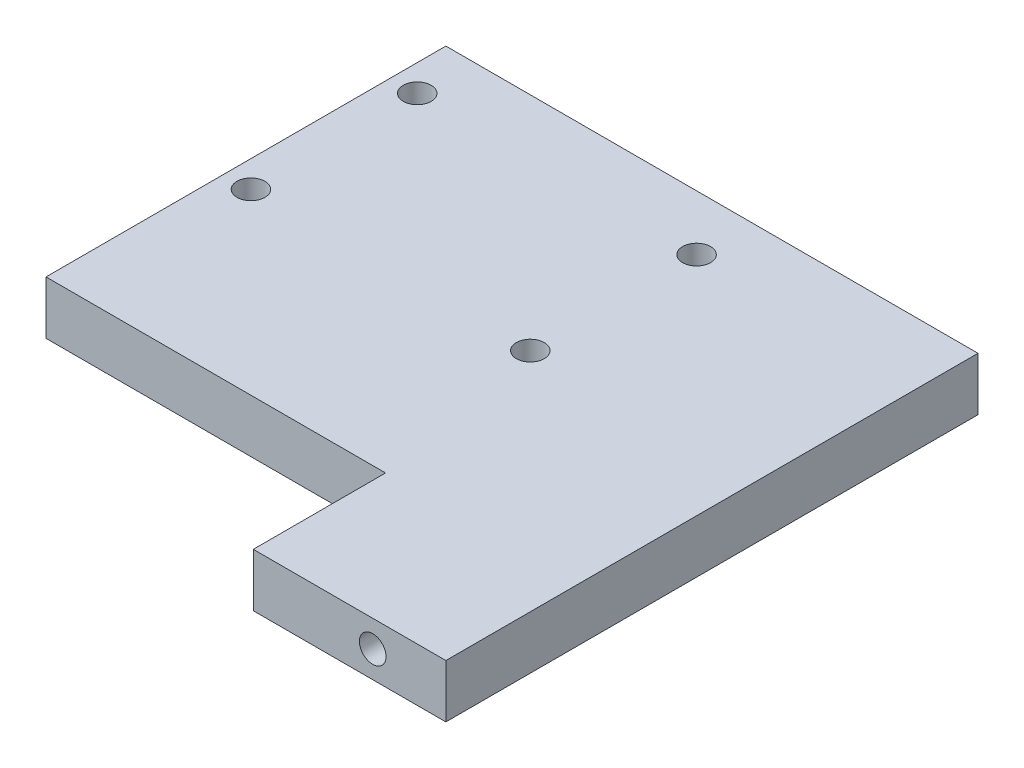
ISO-10303-21;
HEADER;
FILE_DESCRIPTION(('STEP AP214'),'2;1');
FILE_NAME('part.step','',(''),(''),'','','');
FILE_SCHEMA(('AUTOMOTIVE_DESIGN { 1 0 10303 214 1 1 1 1 }'));
ENDSEC;
DATA;
#1=APPLICATION_CONTEXT('core data for automotive mechanical design processes');
#2=APPLICATION_PROTOCOL_DEFINITION('international standard','automotive_design',2000,#1);
#3=PRODUCT_CONTEXT('',#1,'mechanical');
#4=PRODUCT('Part','Part','',(#3));
#5=PRODUCT_RELATED_PRODUCT_CATEGORY('part','',(#4));
#6=PRODUCT_DEFINITION_FORMATION('','',#4);
#7=PRODUCT_DEFINITION_CONTEXT('part definition',#1,'design');
#8=PRODUCT_DEFINITION('design','',#6,#7);
#9=PRODUCT_DEFINITION_SHAPE('','',#8);
#10=(LENGTH_UNIT() NAMED_UNIT(*) SI_UNIT(.MILLI.,.METRE.));
#11=(NAMED_UNIT(*) PLANE_ANGLE_UNIT() SI_UNIT($,.RADIAN.));
#12=(NAMED_UNIT(*) SI_UNIT($,.STERADIAN.) SOLID_ANGLE_UNIT());
#13=UNCERTAINTY_MEASURE_WITH_UNIT(LENGTH_MEASURE(1.E-05),#10,'distance_accuracy_value','');
#14=(GEOMETRIC_REPRESENTATION_CONTEXT(3) GLOBAL_UNCERTAINTY_ASSIGNED_CONTEXT((#13)) GLOBAL_UNIT_ASSIGNED_CONTEXT((#10,
#11,#12)) REPRESENTATION_CONTEXT('',''));
#15=CARTESIAN_POINT('',(0.,0.,0.));
#16=DIRECTION('',(0.,0.,1.));
#17=DIRECTION('',(1.,0.,0.));
#18=AXIS2_PLACEMENT_3D('',#15,#16,#17);
#19=CARTESIAN_POINT('',(20.,4.,20.));
#20=DIRECTION('',(-1.,0.,0.));
#21=DIRECTION('',(0.,0.,1.));
#22=AXIS2_PLACEMENT_3D('',#19,#20,#21);
#23=PLANE('',#22);
#24=DIRECTION('',(0.,0.,-1.));
#25=VECTOR('',#24,1.);
#26=CARTESIAN_POINT('',(20.,0.,20.));
#27=LINE('',#26,#25);
#28=CARTESIAN_POINT('',(20.,0.,20.));
#29=VERTEX_POINT('',#28);
#30=CARTESIAN_POINT('',(20.,0.,-20.));
#31=VERTEX_POINT('',#30);
#32=EDGE_CURVE('E141',#29,#31,#27,.T.);
#33=ORIENTED_EDGE('',*,*,#32,.T.);
#34=DIRECTION('',(0.,-1.,0.));
#35=VECTOR('',#34,1.);
#36=CARTESIAN_POINT('',(20.,4.,-20.));
#37=LINE('',#36,#35);
#38=CARTESIAN_POINT('',(20.,4.,-20.));
#39=VERTEX_POINT('',#38);
#40=EDGE_CURVE('E11',#39,#31,#37,.T.);
#41=ORIENTED_EDGE('',*,*,#40,.F.);
#42=DIRECTION('',(0.,0.,-1.));
#43=VECTOR('',#42,1.);
#44=CARTESIAN_POINT('',(20.,4.,20.));
#45=LINE('',#44,#43);
#46=CARTESIAN_POINT('',(20.,4.,20.));
#47=VERTEX_POINT('',#46);
#48=EDGE_CURVE('E137',#47,#39,#45,.T.);
#49=ORIENTED_EDGE('',*,*,#48,.F.);
#50=DIRECTION('',(0.,-1.,0.));
#51=VECTOR('',#50,1.);
#52=CARTESIAN_POINT('',(20.,4.,20.));
#53=LINE('',#52,#51);
#54=EDGE_CURVE('E135',#47,#29,#53,.T.);
#55=ORIENTED_EDGE('',*,*,#54,.T.);
#56=EDGE_LOOP('',(#33,#41,#49,#55));
#57=FACE_BOUND('',#56,.T.);
#58=ADVANCED_FACE('F35',(#57),#23,.F.);
#59=CARTESIAN_POINT('',(-20.,4.,-20.));
#60=DIRECTION('',(0.,0.,1.));
#61=DIRECTION('',(1.,0.,0.));
#62=AXIS2_PLACEMENT_3D('',#59,#60,#61);
#63=PLANE('',#62);
#64=CARTESIAN_POINT('',(-14.5,2.,-20.));
#65=DIRECTION('',(0.,0.,-1.));
#66=DIRECTION('',(-1.,0.,0.));
#67=AXIS2_PLACEMENT_3D('',#64,#65,#66);
#68=CIRCLE('',#67,1.);
#69=CARTESIAN_POINT('',(-15.5,2.,-20.));
#70=VERTEX_POINT('',#69);
#71=EDGE_CURVE('E187',#70,#70,#68,.T.);
#72=ORIENTED_EDGE('',*,*,#71,.F.);
#73=EDGE_LOOP('',(#72));
#74=FACE_BOUND('',#73,.T.);
#75=CARTESIAN_POINT('',(14.5,2.,-20.));
#76=DIRECTION('',(0.,0.,-1.));
#77=DIRECTION('',(-1.,0.,0.));
#78=AXIS2_PLACEMENT_3D('',#75,#76,#77);
#79=CIRCLE('',#78,1.);
#80=CARTESIAN_POINT('',(13.5,2.,-20.));
#81=VERTEX_POINT('',#80);
#82=EDGE_CURVE('E191',#81,#81,#79,.T.);
#83=ORIENTED_EDGE('',*,*,#82,.F.);
#84=EDGE_LOOP('',(#83));
#85=FACE_BOUND('',#84,.T.);
#86=DIRECTION('',(-1.,0.,0.));
#87=VECTOR('',#86,1.);
#88=CARTESIAN_POINT('',(-20.,0.,-20.));
#89=LINE('',#88,#87);
#90=CARTESIAN_POINT('',(-20.,0.,-20.));
#91=VERTEX_POINT('',#90);
#92=EDGE_CURVE('E144',#31,#91,#89,.T.);
#93=ORIENTED_EDGE('',*,*,#92,.T.);
#94=DIRECTION('',(0.,-1.,0.));
#95=VECTOR('',#94,1.);
#96=CARTESIAN_POINT('',(-20.,4.,-20.));
#97=LINE('',#96,#95);
#98=CARTESIAN_POINT('',(-20.,4.,-20.));
#99=VERTEX_POINT('',#98);
#100=EDGE_CURVE('E42',#99,#91,#97,.T.);
#101=ORIENTED_EDGE('',*,*,#100,.F.);
#102=DIRECTION('',(-1.,0.,0.));
#103=VECTOR('',#102,1.);
#104=CARTESIAN_POINT('',(-20.,4.,-20.));
#105=LINE('',#104,#103);
#106=EDGE_CURVE('E131',#39,#99,#105,.T.);
#107=ORIENTED_EDGE('',*,*,#106,.F.);
#108=ORIENTED_EDGE('',*,*,#40,.T.);
#109=EDGE_LOOP('',(#93,#101,#107,#108));
#110=FACE_BOUND('',#109,.T.);
#111=ADVANCED_FACE('F208',(#74,#85,#110),#63,.F.);
#112=CARTESIAN_POINT('',(-20.,4.,20.));
#113=DIRECTION('',(1.,0.,0.));
#114=DIRECTION('',(0.,0.,-1.));
#115=AXIS2_PLACEMENT_3D('',#112,#113,#114);
#116=PLANE('',#115);
#117=DIRECTION('',(0.,0.,1.));
#118=VECTOR('',#117,1.);
#119=CARTESIAN_POINT('',(-20.,0.,20.));
#120=LINE('',#119,#118);
#121=CARTESIAN_POINT('',(-20.,0.,-0.123296756228797));
#122=VERTEX_POINT('',#121);
#123=CARTESIAN_POINT('',(-20.,0.,10.0582705619843));
#124=VERTEX_POINT('',#123);
#125=EDGE_CURVE('E127',#122,#124,#120,.T.);
#126=ORIENTED_EDGE('',*,*,#125,.T.);
#127=DIRECTION('',(0.,-1.,0.));
#128=VECTOR('',#127,1.);
#129=CARTESIAN_POINT('',(-20.,4.,10.0582705619843));
#130=LINE('',#129,#128);
#131=CARTESIAN_POINT('',(-20.,4.,10.0582705619843));
#132=VERTEX_POINT('',#131);
#133=EDGE_CURVE('E49',#132,#124,#130,.T.);
#134=ORIENTED_EDGE('',*,*,#133,.F.);
#135=DIRECTION('',(0.,0.,1.));
#136=VECTOR('',#135,1.);
#137=CARTESIAN_POINT('',(-20.,4.,20.));
#138=LINE('',#137,#136);
#139=EDGE_CURVE('E125',#99,#132,#138,.T.);
#140=ORIENTED_EDGE('',*,*,#139,.F.);
#141=ORIENTED_EDGE('',*,*,#100,.T.);
#142=CARTESIAN_POINT('',(-20.,0.,-17.8471805011251));
#143=VERTEX_POINT('',#142);
#144=EDGE_CURVE('E147',#91,#143,#120,.T.);
#145=ORIENTED_EDGE('',*,*,#144,.T.);
#146=DIRECTION('',(0.,1.,0.));
#147=VECTOR('',#146,1.);
#148=CARTESIAN_POINT('',(-20.,-1.,-17.8471805011251));
#149=LINE('',#148,#147);
#150=CARTESIAN_POINT('',(-20.,-1.,-17.8471805011251));
#151=VERTEX_POINT('',#150);
#152=EDGE_CURVE('E178',#151,#143,#149,.T.);
#153=ORIENTED_EDGE('',*,*,#152,.F.);
#154=DIRECTION('',(0.,0.,-1.));
#155=VECTOR('',#154,1.);
#156=CARTESIAN_POINT('',(-20.,-1.,-0.123296756228797));
#157=LINE('',#156,#155);
#158=CARTESIAN_POINT('',(-20.,-1.,-0.123296756228797));
#159=VERTEX_POINT('',#158);
#160=EDGE_CURVE('E172',#159,#151,#157,.T.);
#161=ORIENTED_EDGE('',*,*,#160,.F.);
#162=DIRECTION('',(0.,1.,0.));
#163=VECTOR('',#162,1.);
#164=CARTESIAN_POINT('',(-20.,-1.,-0.123296756228797));
#165=LINE('',#164,#163);
#166=EDGE_CURVE('E180',#159,#122,#165,.T.);
#167=ORIENTED_EDGE('',*,*,#166,.T.);
#168=EDGE_LOOP('',(#126,#134,#140,#141,#145,#153,#161,#167));
#169=FACE_BOUND('',#168,.T.);
#170=ADVANCED_FACE('F123',(#169),#116,.F.);
#171=CARTESIAN_POINT('',(-20.,4.,20.));
#172=DIRECTION('',(0.,0.,-1.));
#173=DIRECTION('',(-1.,0.,0.));
#174=AXIS2_PLACEMENT_3D('',#171,#172,#173);
#175=PLANE('',#174);
#176=CARTESIAN_POINT('',(14.5,2.,20.));
#177=DIRECTION('',(0.,0.,1.));
#178=DIRECTION('',(1.,0.,0.));
#179=AXIS2_PLACEMENT_3D('',#176,#177,#178);
#180=CIRCLE('',#179,1.);
#181=CARTESIAN_POINT('',(15.5,2.,20.));
#182=VERTEX_POINT('',#181);
#183=EDGE_CURVE('E197',#182,#182,#180,.T.);
#184=ORIENTED_EDGE('',*,*,#183,.F.);
#185=EDGE_LOOP('',(#184));
#186=FACE_BOUND('',#185,.T.);
#187=DIRECTION('',(1.,0.,0.));
#188=VECTOR('',#187,1.);
#189=CARTESIAN_POINT('',(-20.,4.,20.));
#190=LINE('',#189,#188);
#191=CARTESIAN_POINT('',(5.52379311554674,4.,20.));
#192=VERTEX_POINT('',#191);
#193=EDGE_CURVE('E133',#192,#47,#190,.T.);
#194=ORIENTED_EDGE('',*,*,#193,.F.);
#195=DIRECTION('',(0.,-1.,0.));
#196=VECTOR('',#195,1.);
#197=CARTESIAN_POINT('',(5.52379311554674,4.,20.));
#198=LINE('',#197,#196);
#199=CARTESIAN_POINT('',(5.52379311554674,0.,20.));
#200=VERTEX_POINT('',#199);
#201=EDGE_CURVE('E291',#192,#200,#198,.T.);
#202=ORIENTED_EDGE('',*,*,#201,.T.);
#203=DIRECTION('',(1.,0.,0.));
#204=VECTOR('',#203,1.);
#205=CARTESIAN_POINT('',(-20.,0.,20.));
#206=LINE('',#205,#204);
#207=EDGE_CURVE('E150',#200,#29,#206,.T.);
#208=ORIENTED_EDGE('',*,*,#207,.T.);
#209=ORIENTED_EDGE('',*,*,#54,.F.);
#210=EDGE_LOOP('',(#194,#202,#208,#209));
#211=FACE_BOUND('',#210,.T.);
#212=ADVANCED_FACE('F215',(#186,#211),#175,.F.);
#213=CARTESIAN_POINT('',(0.,4.,0.));
#214=DIRECTION('',(0.,-1.,0.));
#215=DIRECTION('',(0.,0.,-1.));
#216=AXIS2_PLACEMENT_3D('',#213,#214,#215);
#217=PLANE('',#216);
#218=CARTESIAN_POINT('',(2.99888780924207,4.,-15.8460683103671));
#219=DIRECTION('',(0.,-1.,0.));
#220=DIRECTION('',(0.,0.,-1.));
#221=AXIS2_PLACEMENT_3D('',#218,#219,#220);
#222=CIRCLE('',#221,1.05);
#223=CARTESIAN_POINT('',(2.99888780924207,4.,-16.8960683103671));
#224=VERTEX_POINT('',#223);
#225=EDGE_CURVE('E304',#224,#224,#222,.T.);
#226=ORIENTED_EDGE('',*,*,#225,.T.);
#227=EDGE_LOOP('',(#226));
#228=FACE_BOUND('',#227,.T.);
#229=CARTESIAN_POINT('',(2.99888780924207,4.,-3.34606831036715));
#230=DIRECTION('',(0.,-1.,0.));
#231=DIRECTION('',(0.,0.,-1.));
#232=AXIS2_PLACEMENT_3D('',#229,#230,#231);
#233=CIRCLE('',#232,1.05);
#234=CARTESIAN_POINT('',(2.99888780924207,4.,-4.39606831036715));
#235=VERTEX_POINT('',#234);
#236=EDGE_CURVE('E299',#235,#235,#233,.T.);
#237=ORIENTED_EDGE('',*,*,#236,.T.);
#238=EDGE_LOOP('',(#237));
#239=FACE_BOUND('',#238,.T.);
#240=CARTESIAN_POINT('',(-17.9988878092421,4.,-3.34606831036715));
#241=DIRECTION('',(0.,-1.,0.));
#242=DIRECTION('',(0.,0.,-1.));
#243=AXIS2_PLACEMENT_3D('',#240,#241,#242);
#244=CIRCLE('',#243,1.05);
#245=CARTESIAN_POINT('',(-17.9988878092421,4.,-4.39606831036715));
#246=VERTEX_POINT('',#245);
#247=EDGE_CURVE('E296',#246,#246,#244,.T.);
#248=ORIENTED_EDGE('',*,*,#247,.T.);
#249=EDGE_LOOP('',(#248));
#250=FACE_BOUND('',#249,.T.);
#251=CARTESIAN_POINT('',(-17.9988878092421,4.,-15.8460683103671));
#252=DIRECTION('',(0.,-1.,0.));
#253=DIRECTION('',(0.,0.,-1.));
#254=AXIS2_PLACEMENT_3D('',#251,#252,#253);
#255=CIRCLE('',#254,1.05);
#256=CARTESIAN_POINT('',(-17.9988878092421,4.,-16.8960683103671));
#257=VERTEX_POINT('',#256);
#258=EDGE_CURVE('E307',#257,#257,#255,.T.);
#259=ORIENTED_EDGE('',*,*,#258,.T.);
#260=EDGE_LOOP('',(#259));
#261=FACE_BOUND('',#260,.T.);
#262=DIRECTION('',(1.,0.,0.));
#263=VECTOR('',#262,1.);
#264=CARTESIAN_POINT('',(-20.,4.,10.0582705619843));
#265=LINE('',#264,#263);
#266=CARTESIAN_POINT('',(5.52379311554674,4.,10.0582705619843));
#267=VERTEX_POINT('',#266);
#268=EDGE_CURVE('E110',#132,#267,#265,.T.);
#269=ORIENTED_EDGE('',*,*,#268,.T.);
#270=DIRECTION('',(0.,0.,1.));
#271=VECTOR('',#270,1.);
#272=CARTESIAN_POINT('',(5.52379311554674,4.,10.0582705619843));
#273=LINE('',#272,#271);
#274=EDGE_CURVE('E117',#267,#192,#273,.T.);
#275=ORIENTED_EDGE('',*,*,#274,.T.);
#276=ORIENTED_EDGE('',*,*,#193,.T.);
#277=ORIENTED_EDGE('',*,*,#48,.T.);
#278=ORIENTED_EDGE('',*,*,#106,.T.);
#279=ORIENTED_EDGE('',*,*,#139,.T.);
#280=EDGE_LOOP('',(#269,#275,#276,#277,#278,#279));
#281=FACE_BOUND('',#280,.T.);
#282=ADVANCED_FACE('F129',(#228,#239,#250,#261,#281),#217,.F.);
#283=CARTESIAN_POINT('',(0.,0.,0.));
#284=DIRECTION('',(0.,-1.,0.));
#285=DIRECTION('',(0.,0.,-1.));
#286=AXIS2_PLACEMENT_3D('',#283,#284,#285);
#287=PLANE('',#286);
#288=DIRECTION('',(0.,0.,1.));
#289=VECTOR('',#288,1.);
#290=CARTESIAN_POINT('',(5.52379311554674,0.,10.0582705619843));
#291=LINE('',#290,#289);
#292=CARTESIAN_POINT('',(5.52379311554674,0.,10.0582705619843));
#293=VERTEX_POINT('',#292);
#294=EDGE_CURVE('E118',#293,#200,#291,.T.);
#295=ORIENTED_EDGE('',*,*,#294,.F.);
#296=DIRECTION('',(1.,0.,0.));
#297=VECTOR('',#296,1.);
#298=CARTESIAN_POINT('',(-20.,0.,10.0582705619843));
#299=LINE('',#298,#297);
#300=EDGE_CURVE('E293',#124,#293,#299,.T.);
#301=ORIENTED_EDGE('',*,*,#300,.F.);
#302=ORIENTED_EDGE('',*,*,#125,.F.);
#303=DIRECTION('',(-1.,0.,0.));
#304=VECTOR('',#303,1.);
#305=CARTESIAN_POINT('',(5.,0.,-0.123296756228797));
#306=LINE('',#305,#304);
#307=CARTESIAN_POINT('',(5.,0.,-0.123296756228797));
#308=VERTEX_POINT('',#307);
#309=EDGE_CURVE('E166',#308,#122,#306,.T.);
#310=ORIENTED_EDGE('',*,*,#309,.F.);
#311=DIRECTION('',(0.,0.,1.));
#312=VECTOR('',#311,1.);
#313=CARTESIAN_POINT('',(5.,0.,-0.123296756228797));
#314=LINE('',#313,#312);
#315=CARTESIAN_POINT('',(5.,0.,-17.8471805011251));
#316=VERTEX_POINT('',#315);
#317=EDGE_CURVE('E57',#316,#308,#314,.T.);
#318=ORIENTED_EDGE('',*,*,#317,.F.);
#319=DIRECTION('',(1.,0.,0.));
#320=VECTOR('',#319,1.);
#321=CARTESIAN_POINT('',(5.,0.,-17.8471805011251));
#322=LINE('',#321,#320);
#323=EDGE_CURVE('E161',#143,#316,#322,.T.);
#324=ORIENTED_EDGE('',*,*,#323,.F.);
#325=ORIENTED_EDGE('',*,*,#144,.F.);
#326=ORIENTED_EDGE('',*,*,#92,.F.);
#327=ORIENTED_EDGE('',*,*,#32,.F.);
#328=ORIENTED_EDGE('',*,*,#207,.F.);
#329=EDGE_LOOP('',(#295,#301,#302,#310,#318,#324,#325,#326,#327,#328));
#330=FACE_BOUND('',#329,.T.);
#331=ADVANCED_FACE('F158',(#330),#287,.T.);
#332=CARTESIAN_POINT('',(14.5,2.,18.));
#333=DIRECTION('',(0.,0.,1.));
#334=DIRECTION('',(1.,0.,0.));
#335=AXIS2_PLACEMENT_3D('',#332,#333,#334);
#336=CYLINDRICAL_SURFACE('',#335,1.);
#337=CARTESIAN_POINT('',(14.5,2.,18.));
#338=DIRECTION('',(0.,0.,1.));
#339=DIRECTION('',(1.,0.,0.));
#340=AXIS2_PLACEMENT_3D('',#337,#338,#339);
#341=CIRCLE('',#340,1.);
#342=CARTESIAN_POINT('',(15.5,2.,18.));
#343=VERTEX_POINT('',#342);
#344=EDGE_CURVE('E145',#343,#343,#341,.T.);
#345=ORIENTED_EDGE('',*,*,#344,.F.);
#346=EDGE_LOOP('',(#345));
#347=FACE_BOUND('',#346,.T.);
#348=ORIENTED_EDGE('',*,*,#183,.T.);
#349=EDGE_LOOP('',(#348));
#350=FACE_BOUND('',#349,.T.);
#351=ADVANCED_FACE('F225',(#347,#350),#336,.F.);
#352=CARTESIAN_POINT('',(14.5,2.,18.));
#353=DIRECTION('',(0.,0.,1.));
#354=DIRECTION('',(1.,0.,0.));
#355=AXIS2_PLACEMENT_3D('',#352,#353,#354);
#356=PLANE('',#355);
#357=ORIENTED_EDGE('',*,*,#344,.T.);
#358=EDGE_LOOP('',(#357));
#359=FACE_BOUND('',#358,.T.);
#360=ADVANCED_FACE('F231',(#359),#356,.T.);
#361=CARTESIAN_POINT('',(14.5,2.,-18.));
#362=DIRECTION('',(0.,0.,-1.));
#363=DIRECTION('',(-1.,0.,0.));
#364=AXIS2_PLACEMENT_3D('',#361,#362,#363);
#365=CYLINDRICAL_SURFACE('',#364,1.);
#366=CARTESIAN_POINT('',(14.5,2.,-18.));
#367=DIRECTION('',(0.,0.,-1.));
#368=DIRECTION('',(-1.,0.,0.));
#369=AXIS2_PLACEMENT_3D('',#366,#367,#368);
#370=CIRCLE('',#369,1.);
#371=CARTESIAN_POINT('',(13.5,2.,-18.));
#372=VERTEX_POINT('',#371);
#373=EDGE_CURVE('E194',#372,#372,#370,.T.);
#374=ORIENTED_EDGE('',*,*,#373,.F.);
#375=EDGE_LOOP('',(#374));
#376=FACE_BOUND('',#375,.T.);
#377=ORIENTED_EDGE('',*,*,#82,.T.);
#378=EDGE_LOOP('',(#377));
#379=FACE_BOUND('',#378,.T.);
#380=ADVANCED_FACE('F235',(#376,#379),#365,.F.);
#381=CARTESIAN_POINT('',(14.5,2.,-18.));
#382=DIRECTION('',(0.,0.,-1.));
#383=DIRECTION('',(-1.,0.,0.));
#384=AXIS2_PLACEMENT_3D('',#381,#382,#383);
#385=PLANE('',#384);
#386=ORIENTED_EDGE('',*,*,#373,.T.);
#387=EDGE_LOOP('',(#386));
#388=FACE_BOUND('',#387,.T.);
#389=ADVANCED_FACE('F239',(#388),#385,.T.);
#390=CARTESIAN_POINT('',(-14.5,2.,-18.));
#391=DIRECTION('',(0.,0.,-1.));
#392=DIRECTION('',(-1.,0.,0.));
#393=AXIS2_PLACEMENT_3D('',#390,#391,#392);
#394=CYLINDRICAL_SURFACE('',#393,1.);
#395=CARTESIAN_POINT('',(-14.5,2.,-18.));
#396=DIRECTION('',(0.,0.,-1.));
#397=DIRECTION('',(-1.,0.,0.));
#398=AXIS2_PLACEMENT_3D('',#395,#396,#397);
#399=CIRCLE('',#398,1.);
#400=CARTESIAN_POINT('',(-15.5,2.,-18.));
#401=VERTEX_POINT('',#400);
#402=EDGE_CURVE('E188',#401,#401,#399,.T.);
#403=ORIENTED_EDGE('',*,*,#402,.F.);
#404=EDGE_LOOP('',(#403));
#405=FACE_BOUND('',#404,.T.);
#406=ORIENTED_EDGE('',*,*,#71,.T.);
#407=EDGE_LOOP('',(#406));
#408=FACE_BOUND('',#407,.T.);
#409=ADVANCED_FACE('F243',(#405,#408),#394,.F.);
#410=CARTESIAN_POINT('',(-14.5,2.,-18.));
#411=DIRECTION('',(0.,0.,-1.));
#412=DIRECTION('',(-1.,0.,0.));
#413=AXIS2_PLACEMENT_3D('',#410,#411,#412);
#414=PLANE('',#413);
#415=ORIENTED_EDGE('',*,*,#402,.T.);
#416=EDGE_LOOP('',(#415));
#417=FACE_BOUND('',#416,.T.);
#418=ADVANCED_FACE('F247',(#417),#414,.T.);
#419=CARTESIAN_POINT('',(0.,-1.,0.));
#420=DIRECTION('',(0.,-1.,0.));
#421=DIRECTION('',(0.,0.,-1.));
#422=AXIS2_PLACEMENT_3D('',#419,#420,#421);
#423=PLANE('',#422);
#424=CARTESIAN_POINT('',(2.99888780924207,-1.,-3.34606831036715));
#425=DIRECTION('',(0.,-1.,0.));
#426=DIRECTION('',(0.,0.,-1.));
#427=AXIS2_PLACEMENT_3D('',#424,#425,#426);
#428=CIRCLE('',#427,1.05);
#429=CARTESIAN_POINT('',(2.99888780924207,-1.,-4.39606831036715));
#430=VERTEX_POINT('',#429);
#431=EDGE_CURVE('E315',#430,#430,#428,.T.);
#432=ORIENTED_EDGE('',*,*,#431,.F.);
#433=EDGE_LOOP('',(#432));
#434=FACE_BOUND('',#433,.T.);
#435=CARTESIAN_POINT('',(-17.9988878092421,-1.,-15.8460683103671));
#436=DIRECTION('',(0.,-1.,0.));
#437=DIRECTION('',(0.,0.,-1.));
#438=AXIS2_PLACEMENT_3D('',#435,#436,#437);
#439=CIRCLE('',#438,1.05);
#440=CARTESIAN_POINT('',(-17.9988878092421,-1.,-16.8960683103671));
#441=VERTEX_POINT('',#440);
#442=EDGE_CURVE('E164',#441,#441,#439,.T.);
#443=ORIENTED_EDGE('',*,*,#442,.F.);
#444=EDGE_LOOP('',(#443));
#445=FACE_BOUND('',#444,.T.);
#446=DIRECTION('',(1.,0.,0.));
#447=VECTOR('',#446,1.);
#448=CARTESIAN_POINT('',(5.,-1.,-17.8471805011251));
#449=LINE('',#448,#447);
#450=CARTESIAN_POINT('',(5.,-1.,-17.8471805011251));
#451=VERTEX_POINT('',#450);
#452=EDGE_CURVE('E177',#151,#451,#449,.T.);
#453=ORIENTED_EDGE('',*,*,#452,.T.);
#454=DIRECTION('',(0.,0.,1.));
#455=VECTOR('',#454,1.);
#456=CARTESIAN_POINT('',(5.,-1.,-0.123296756228797));
#457=LINE('',#456,#455);
#458=CARTESIAN_POINT('',(5.,-1.,-0.123296756228797));
#459=VERTEX_POINT('',#458);
#460=EDGE_CURVE('E322',#451,#459,#457,.T.);
#461=ORIENTED_EDGE('',*,*,#460,.T.);
#462=DIRECTION('',(-1.,0.,0.));
#463=VECTOR('',#462,1.);
#464=CARTESIAN_POINT('',(5.,-1.,-0.123296756228797));
#465=LINE('',#464,#463);
#466=EDGE_CURVE('E323',#459,#159,#465,.T.);
#467=ORIENTED_EDGE('',*,*,#466,.T.);
#468=ORIENTED_EDGE('',*,*,#160,.T.);
#469=EDGE_LOOP('',(#453,#461,#467,#468));
#470=FACE_BOUND('',#469,.T.);
#471=CARTESIAN_POINT('',(2.99888780924207,-1.,-15.8460683103671));
#472=DIRECTION('',(0.,-1.,0.));
#473=DIRECTION('',(0.,0.,-1.));
#474=AXIS2_PLACEMENT_3D('',#471,#472,#473);
#475=CIRCLE('',#474,1.05);
#476=CARTESIAN_POINT('',(2.99888780924207,-1.,-16.8960683103671));
#477=VERTEX_POINT('',#476);
#478=EDGE_CURVE('E169',#477,#477,#475,.T.);
#479=ORIENTED_EDGE('',*,*,#478,.F.);
#480=EDGE_LOOP('',(#479));
#481=FACE_BOUND('',#480,.T.);
#482=CARTESIAN_POINT('',(-17.9988878092421,-1.,-3.34606831036715));
#483=DIRECTION('',(0.,-1.,0.));
#484=DIRECTION('',(0.,0.,-1.));
#485=AXIS2_PLACEMENT_3D('',#482,#483,#484);
#486=CIRCLE('',#485,1.05);
#487=CARTESIAN_POINT('',(-17.9988878092421,-1.,-4.39606831036715));
#488=VERTEX_POINT('',#487);
#489=EDGE_CURVE('E312',#488,#488,#486,.T.);
#490=ORIENTED_EDGE('',*,*,#489,.F.);
#491=EDGE_LOOP('',(#490));
#492=FACE_BOUND('',#491,.T.);
#493=ADVANCED_FACE('F251',(#434,#445,#470,#481,#492),#423,.T.);
#494=CARTESIAN_POINT('',(5.,-1.,-17.8471805011251));
#495=DIRECTION('',(0.,0.,1.));
#496=DIRECTION('',(1.,0.,0.));
#497=AXIS2_PLACEMENT_3D('',#494,#495,#496);
#498=PLANE('',#497);
#499=ORIENTED_EDGE('',*,*,#323,.T.);
#500=DIRECTION('',(0.,1.,0.));
#501=VECTOR('',#500,1.);
#502=CARTESIAN_POINT('',(5.,-1.,-17.8471805011251));
#503=LINE('',#502,#501);
#504=EDGE_CURVE('E185',#451,#316,#503,.T.);
#505=ORIENTED_EDGE('',*,*,#504,.F.);
#506=ORIENTED_EDGE('',*,*,#452,.F.);
#507=ORIENTED_EDGE('',*,*,#152,.T.);
#508=EDGE_LOOP('',(#499,#505,#506,#507));
#509=FACE_BOUND('',#508,.T.);
#510=ADVANCED_FACE('F253',(#509),#498,.F.);
#511=CARTESIAN_POINT('',(5.,-1.,-0.123296756228797));
#512=DIRECTION('',(-1.,0.,0.));
#513=DIRECTION('',(0.,0.,1.));
#514=AXIS2_PLACEMENT_3D('',#511,#512,#513);
#515=PLANE('',#514);
#516=ORIENTED_EDGE('',*,*,#317,.T.);
#517=DIRECTION('',(0.,1.,0.));
#518=VECTOR('',#517,1.);
#519=CARTESIAN_POINT('',(5.,-1.,-0.123296756228797));
#520=LINE('',#519,#518);
#521=EDGE_CURVE('E182',#459,#308,#520,.T.);
#522=ORIENTED_EDGE('',*,*,#521,.F.);
#523=ORIENTED_EDGE('',*,*,#460,.F.);
#524=ORIENTED_EDGE('',*,*,#504,.T.);
#525=EDGE_LOOP('',(#516,#522,#523,#524));
#526=FACE_BOUND('',#525,.T.);
#527=ADVANCED_FACE('F256',(#526),#515,.F.);
#528=CARTESIAN_POINT('',(5.,-1.,-0.123296756228797));
#529=DIRECTION('',(0.,0.,-1.));
#530=DIRECTION('',(-1.,0.,0.));
#531=AXIS2_PLACEMENT_3D('',#528,#529,#530);
#532=PLANE('',#531);
#533=ORIENTED_EDGE('',*,*,#309,.T.);
#534=ORIENTED_EDGE('',*,*,#166,.F.);
#535=ORIENTED_EDGE('',*,*,#466,.F.);
#536=ORIENTED_EDGE('',*,*,#521,.T.);
#537=EDGE_LOOP('',(#533,#534,#535,#536));
#538=FACE_BOUND('',#537,.T.);
#539=ADVANCED_FACE('F259',(#538),#532,.F.);
#540=CARTESIAN_POINT('',(-17.9988878092421,-1.,-15.8460683103671));
#541=DIRECTION('',(0.,1.,0.));
#542=DIRECTION('',(0.,0.,1.));
#543=AXIS2_PLACEMENT_3D('',#540,#541,#542);
#544=CYLINDRICAL_SURFACE('',#543,1.05);
#545=ORIENTED_EDGE('',*,*,#442,.T.);
#546=EDGE_LOOP('',(#545));
#547=FACE_BOUND('',#546,.T.);
#548=ORIENTED_EDGE('',*,*,#258,.F.);
#549=EDGE_LOOP('',(#548));
#550=FACE_BOUND('',#549,.T.);
#551=ADVANCED_FACE('F263',(#547,#550),#544,.F.);
#552=CARTESIAN_POINT('',(2.99888780924207,-1.,-15.8460683103671));
#553=DIRECTION('',(0.,1.,0.));
#554=DIRECTION('',(0.,0.,1.));
#555=AXIS2_PLACEMENT_3D('',#552,#553,#554);
#556=CYLINDRICAL_SURFACE('',#555,1.05);
#557=ORIENTED_EDGE('',*,*,#478,.T.);
#558=EDGE_LOOP('',(#557));
#559=FACE_BOUND('',#558,.T.);
#560=ORIENTED_EDGE('',*,*,#225,.F.);
#561=EDGE_LOOP('',(#560));
#562=FACE_BOUND('',#561,.T.);
#563=ADVANCED_FACE('F270',(#559,#562),#556,.F.);
#564=CARTESIAN_POINT('',(2.99888780924207,-1.,-3.34606831036715));
#565=DIRECTION('',(0.,1.,0.));
#566=DIRECTION('',(0.,0.,1.));
#567=AXIS2_PLACEMENT_3D('',#564,#565,#566);
#568=CYLINDRICAL_SURFACE('',#567,1.05);
#569=ORIENTED_EDGE('',*,*,#431,.T.);
#570=EDGE_LOOP('',(#569));
#571=FACE_BOUND('',#570,.T.);
#572=ORIENTED_EDGE('',*,*,#236,.F.);
#573=EDGE_LOOP('',(#572));
#574=FACE_BOUND('',#573,.T.);
#575=ADVANCED_FACE('F274',(#571,#574),#568,.F.);
#576=CARTESIAN_POINT('',(-17.9988878092421,-1.,-3.34606831036715));
#577=DIRECTION('',(0.,1.,0.));
#578=DIRECTION('',(0.,0.,1.));
#579=AXIS2_PLACEMENT_3D('',#576,#577,#578);
#580=CYLINDRICAL_SURFACE('',#579,1.05);
#581=ORIENTED_EDGE('',*,*,#489,.T.);
#582=EDGE_LOOP('',(#581));
#583=FACE_BOUND('',#582,.T.);
#584=ORIENTED_EDGE('',*,*,#247,.F.);
#585=EDGE_LOOP('',(#584));
#586=FACE_BOUND('',#585,.T.);
#587=ADVANCED_FACE('F278',(#583,#586),#580,.F.);
#588=CARTESIAN_POINT('',(5.52379311554674,4.,10.0582705619843));
#589=DIRECTION('',(1.,0.,0.));
#590=DIRECTION('',(0.,0.,-1.));
#591=AXIS2_PLACEMENT_3D('',#588,#589,#590);
#592=PLANE('',#591);
#593=ORIENTED_EDGE('',*,*,#294,.T.);
#594=ORIENTED_EDGE('',*,*,#201,.F.);
#595=ORIENTED_EDGE('',*,*,#274,.F.);
#596=DIRECTION('',(0.,-1.,0.));
#597=VECTOR('',#596,1.);
#598=CARTESIAN_POINT('',(5.52379311554674,4.,10.0582705619843));
#599=LINE('',#598,#597);
#600=EDGE_CURVE('E112',#267,#293,#599,.T.);
#601=ORIENTED_EDGE('',*,*,#600,.T.);
#602=EDGE_LOOP('',(#593,#594,#595,#601));
#603=FACE_BOUND('',#602,.T.);
#604=ADVANCED_FACE('F282',(#603),#592,.F.);
#605=CARTESIAN_POINT('',(-20.,4.,10.0582705619843));
#606=DIRECTION('',(0.,0.,-1.));
#607=DIRECTION('',(-1.,0.,0.));
#608=AXIS2_PLACEMENT_3D('',#605,#606,#607);
#609=PLANE('',#608);
#610=ORIENTED_EDGE('',*,*,#300,.T.);
#611=ORIENTED_EDGE('',*,*,#600,.F.);
#612=ORIENTED_EDGE('',*,*,#268,.F.);
#613=ORIENTED_EDGE('',*,*,#133,.T.);
#614=EDGE_LOOP('',(#610,#611,#612,#613));
#615=FACE_BOUND('',#614,.T.);
#616=ADVANCED_FACE('F111',(#615),#609,.F.);
#617=CLOSED_SHELL('',(#58,#111,#170,#212,#282,#331,#351,#360,#380,#389,#409,#418,#493,#510,#527,
#539,#551,#563,#575,#587,#604,#616));
#618=MANIFOLD_SOLID_BREP('B2',#617);
#619=ADVANCED_BREP_SHAPE_REPRESENTATION('',(#18,#618),#14);
#620=SHAPE_DEFINITION_REPRESENTATION(#9,#619);
ENDSEC;
END-ISO-10303-21;
